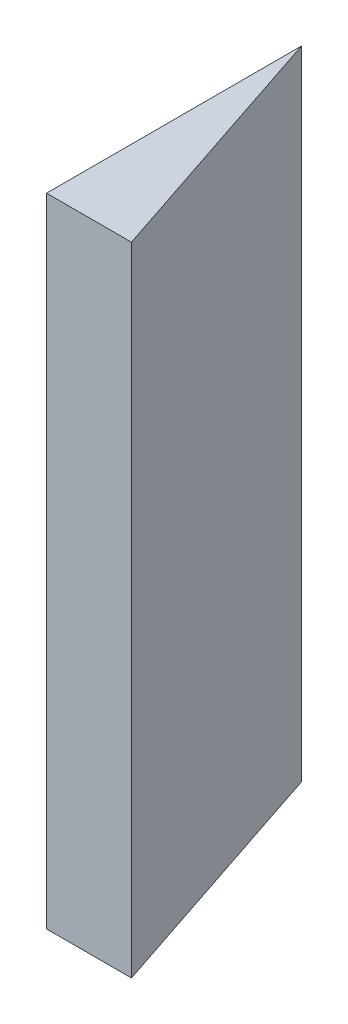
ISO-10303-21;
HEADER;
FILE_DESCRIPTION(('STEP AP214'),'2;1');
FILE_NAME('part.step','',(''),(''),'','','');
FILE_SCHEMA(('AUTOMOTIVE_DESIGN { 1 0 10303 214 1 1 1 1 }'));
ENDSEC;
DATA;
#1=APPLICATION_CONTEXT('core data for automotive mechanical design processes');
#2=APPLICATION_PROTOCOL_DEFINITION('international standard','automotive_design',2000,#1);
#3=PRODUCT_CONTEXT('',#1,'mechanical');
#4=PRODUCT('Part','Part','',(#3));
#5=PRODUCT_RELATED_PRODUCT_CATEGORY('part','',(#4));
#6=PRODUCT_DEFINITION_FORMATION('','',#4);
#7=PRODUCT_DEFINITION_CONTEXT('part definition',#1,'design');
#8=PRODUCT_DEFINITION('design','',#6,#7);
#9=PRODUCT_DEFINITION_SHAPE('','',#8);
#10=(LENGTH_UNIT() NAMED_UNIT(*) SI_UNIT(.MILLI.,.METRE.));
#11=(NAMED_UNIT(*) PLANE_ANGLE_UNIT() SI_UNIT($,.RADIAN.));
#12=(NAMED_UNIT(*) SI_UNIT($,.STERADIAN.) SOLID_ANGLE_UNIT());
#13=UNCERTAINTY_MEASURE_WITH_UNIT(LENGTH_MEASURE(1.E-05),#10,'distance_accuracy_value','');
#14=(GEOMETRIC_REPRESENTATION_CONTEXT(3) GLOBAL_UNCERTAINTY_ASSIGNED_CONTEXT((#13)) GLOBAL_UNIT_ASSIGNED_CONTEXT((#10,
#11,#12)) REPRESENTATION_CONTEXT('',''));
#15=CARTESIAN_POINT('',(0.,0.,0.));
#16=DIRECTION('',(0.,0.,1.));
#17=DIRECTION('',(1.,0.,0.));
#18=AXIS2_PLACEMENT_3D('',#15,#16,#17);
#19=CARTESIAN_POINT('',(-3.92,-0.750000181838375,-3.67112158656318));
#20=DIRECTION('',(0.,-1.,-8.74227765734759E-08));
#21=DIRECTION('',(1.,0.,0.));
#22=AXIS2_PLACEMENT_3D('',#19,#20,#21);
#23=PLANE('',#22);
#24=DIRECTION('',(0.,8.74227765179643E-08,-0.999999999999996));
#25=VECTOR('',#24,1.);
#26=CARTESIAN_POINT('',(-3.9,-0.750000218555941,-3.25112158656318));
#27=LINE('',#26,#25);
#28=CARTESIAN_POINT('',(-3.9,-0.750000218557941,-3.25112158656318));
#29=VERTEX_POINT('',#28);
#30=CARTESIAN_POINT('',(-3.9,-0.750000183588831,-3.65112158656318));
#31=VERTEX_POINT('',#30);
#32=EDGE_CURVE('E11',#29,#31,#27,.T.);
#33=ORIENTED_EDGE('',*,*,#32,.F.);
#34=DIRECTION('',(-1.,0.,0.));
#35=VECTOR('',#34,1.);
#36=CARTESIAN_POINT('',(-3.766777825356,-0.750000218555941,-3.25112158656318));
#37=LINE('',#36,#35);
#38=CARTESIAN_POINT('',(-3.766777825356,-0.750000218557941,-3.25112158656318));
#39=VERTEX_POINT('',#38);
#40=EDGE_CURVE('E63',#39,#29,#37,.T.);
#41=ORIENTED_EDGE('',*,*,#40,.F.);
#42=DIRECTION('',(0.315990463967206,-8.29434402704584E-08,0.948762365759616));
#43=VECTOR('',#42,1.);
#44=CARTESIAN_POINT('',(-3.9,-0.750000183586831,-3.65112158656318));
#45=LINE('',#44,#43);
#46=EDGE_CURVE('E70',#31,#39,#45,.T.);
#47=ORIENTED_EDGE('',*,*,#46,.F.);
#48=EDGE_LOOP('',(#33,#41,#47));
#49=FACE_BOUND('',#48,.T.);
#50=ADVANCED_FACE('F17',(#49),#23,.F.);
#51=CARTESIAN_POINT('',(-3.92,-1.75000018183938,-3.67112167398595));
#52=DIRECTION('',(0.,-1.,-8.74227765734759E-08));
#53=DIRECTION('',(1.,0.,0.));
#54=AXIS2_PLACEMENT_3D('',#51,#52,#53);
#55=PLANE('',#54);
#56=DIRECTION('',(0.315990463967206,-8.2943440007124E-08,0.948762365759616));
#57=VECTOR('',#56,1.);
#58=CARTESIAN_POINT('',(-3.9,-1.75000018358783,-3.65112167398595));
#59=LINE('',#58,#57);
#60=CARTESIAN_POINT('',(-3.9,-1.75000018358683,-3.65112167398595));
#61=VERTEX_POINT('',#60);
#62=CARTESIAN_POINT('',(-3.766777825356,-1.75000021855594,-3.25112167398595));
#63=VERTEX_POINT('',#62);
#64=EDGE_CURVE('E24',#61,#63,#59,.T.);
#65=ORIENTED_EDGE('',*,*,#64,.T.);
#66=DIRECTION('',(-1.,0.,0.));
#67=VECTOR('',#66,1.);
#68=CARTESIAN_POINT('',(-3.766777825356,-1.75000021855694,-3.25112167398595));
#69=LINE('',#68,#67);
#70=CARTESIAN_POINT('',(-3.9,-1.75000021855594,-3.25112167398595));
#71=VERTEX_POINT('',#70);
#72=EDGE_CURVE('E49',#63,#71,#69,.T.);
#73=ORIENTED_EDGE('',*,*,#72,.T.);
#74=DIRECTION('',(0.,8.74227762404085E-08,-0.999999999999996));
#75=VECTOR('',#74,1.);
#76=CARTESIAN_POINT('',(-3.9,-1.75000021855694,-3.25112167398595));
#77=LINE('',#76,#75);
#78=EDGE_CURVE('E46',#71,#61,#77,.T.);
#79=ORIENTED_EDGE('',*,*,#78,.T.);
#80=EDGE_LOOP('',(#65,#73,#79));
#81=FACE_BOUND('',#80,.T.);
#82=ADVANCED_FACE('F47',(#81),#55,.T.);
#83=CARTESIAN_POINT('',(-3.9,-0.750000183586831,-3.65112158656318));
#84=DIRECTION('',(0.948762365759619,2.76247637570875E-08,-0.315990463967207));
#85=DIRECTION('',(0.315990463967207,-8.29434403231256E-08,0.948762365759619));
#86=AXIS2_PLACEMENT_3D('',#83,#84,#85);
#87=PLANE('',#86);
#88=ORIENTED_EDGE('',*,*,#46,.T.);
#89=DIRECTION('',(0.,-0.999999999999996,-8.74227765733881E-08));
#90=VECTOR('',#89,1.);
#91=CARTESIAN_POINT('',(-3.766777825356,-0.750000218555941,-3.25112158656318));
#92=LINE('',#91,#90);
#93=EDGE_CURVE('E54',#39,#63,#92,.T.);
#94=ORIENTED_EDGE('',*,*,#93,.T.);
#95=ORIENTED_EDGE('',*,*,#64,.F.);
#96=DIRECTION('',(0.,-0.999999999999996,-8.74227765733881E-08));
#97=VECTOR('',#96,1.);
#98=CARTESIAN_POINT('',(-3.9,-0.750000183586831,-3.65112158656318));
#99=LINE('',#98,#97);
#100=EDGE_CURVE('E61',#31,#61,#99,.T.);
#101=ORIENTED_EDGE('',*,*,#100,.F.);
#102=EDGE_LOOP('',(#88,#94,#95,#101));
#103=FACE_BOUND('',#102,.T.);
#104=ADVANCED_FACE('F60',(#103),#87,.T.);
#105=CARTESIAN_POINT('',(-3.766777825356,-0.750000218555941,-3.25112158656318));
#106=DIRECTION('',(0.,-8.74227765734759E-08,1.));
#107=DIRECTION('',(-1.,0.,0.));
#108=AXIS2_PLACEMENT_3D('',#105,#106,#107);
#109=PLANE('',#108);
#110=ORIENTED_EDGE('',*,*,#40,.T.);
#111=DIRECTION('',(0.,-0.999999999999996,-8.74227765733881E-08));
#112=VECTOR('',#111,1.);
#113=CARTESIAN_POINT('',(-3.9,-0.750000218555941,-3.25112158656318));
#114=LINE('',#113,#112);
#115=EDGE_CURVE('E55',#29,#71,#114,.T.);
#116=ORIENTED_EDGE('',*,*,#115,.T.);
#117=ORIENTED_EDGE('',*,*,#72,.F.);
#118=ORIENTED_EDGE('',*,*,#93,.F.);
#119=EDGE_LOOP('',(#110,#116,#117,#118));
#120=FACE_BOUND('',#119,.T.);
#121=ADVANCED_FACE('F73',(#120),#109,.T.);
#122=CARTESIAN_POINT('',(-3.9,-0.750000218555941,-3.25112158656318));
#123=DIRECTION('',(-1.,0.,0.));
#124=DIRECTION('',(0.,8.74227765734759E-08,-1.));
#125=AXIS2_PLACEMENT_3D('',#122,#123,#124);
#126=PLANE('',#125);
#127=ORIENTED_EDGE('',*,*,#32,.T.);
#128=ORIENTED_EDGE('',*,*,#100,.T.);
#129=ORIENTED_EDGE('',*,*,#78,.F.);
#130=ORIENTED_EDGE('',*,*,#115,.F.);
#131=EDGE_LOOP('',(#127,#128,#129,#130));
#132=FACE_BOUND('',#131,.T.);
#133=ADVANCED_FACE('F64',(#132),#126,.T.);
#134=CLOSED_SHELL('',(#50,#82,#104,#121,#133));
#135=MANIFOLD_SOLID_BREP('B1',#134);
#136=ADVANCED_BREP_SHAPE_REPRESENTATION('',(#18,#135),#14);
#137=SHAPE_DEFINITION_REPRESENTATION(#9,#136);
ENDSEC;
END-ISO-10303-21;
